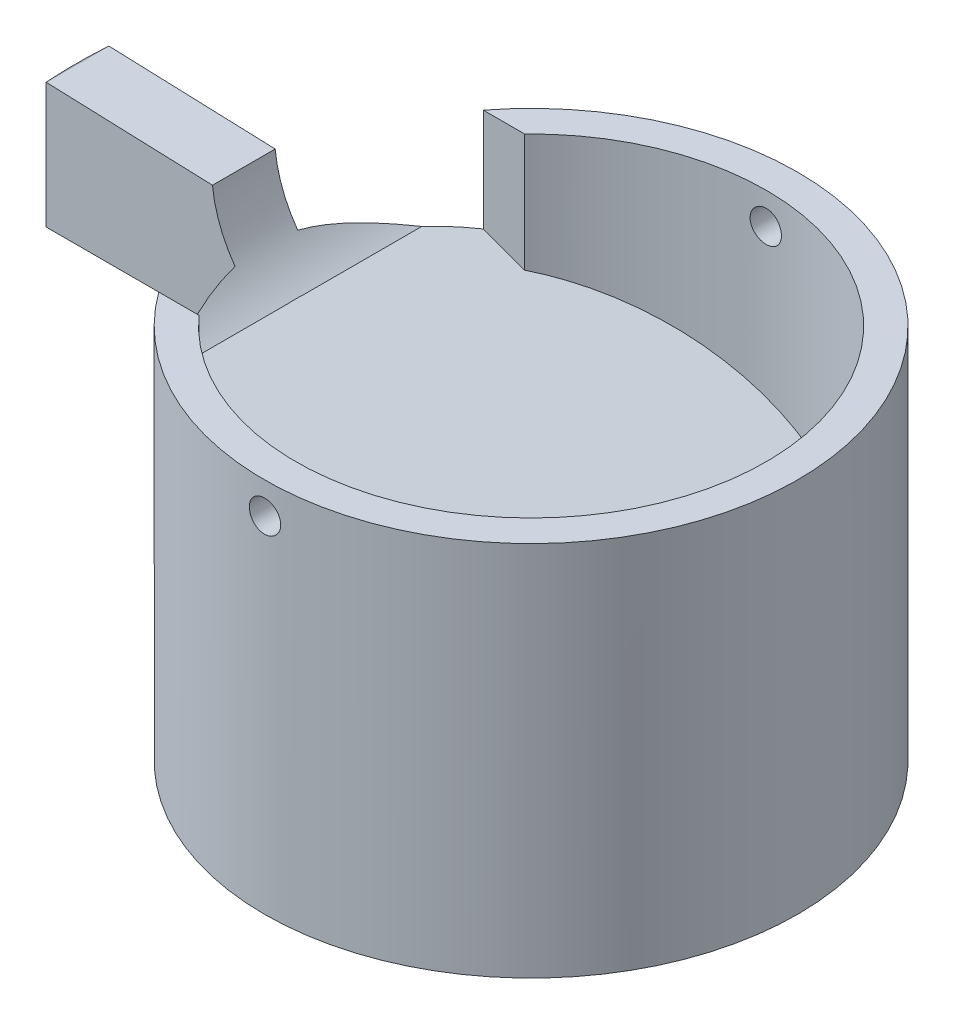
ISO-10303-21;
HEADER;
FILE_DESCRIPTION(('STEP AP214'),'2;1');
FILE_NAME('part.step','',(''),(''),'','','');
FILE_SCHEMA(('AUTOMOTIVE_DESIGN { 1 0 10303 214 1 1 1 1 }'));
ENDSEC;
DATA;
#1=APPLICATION_CONTEXT('core data for automotive mechanical design processes');
#2=APPLICATION_PROTOCOL_DEFINITION('international standard','automotive_design',2000,#1);
#3=PRODUCT_CONTEXT('',#1,'mechanical');
#4=PRODUCT('Part','Part','',(#3));
#5=PRODUCT_RELATED_PRODUCT_CATEGORY('part','',(#4));
#6=PRODUCT_DEFINITION_FORMATION('','',#4);
#7=PRODUCT_DEFINITION_CONTEXT('part definition',#1,'design');
#8=PRODUCT_DEFINITION('design','',#6,#7);
#9=PRODUCT_DEFINITION_SHAPE('','',#8);
#10=(LENGTH_UNIT() NAMED_UNIT(*) SI_UNIT(.MILLI.,.METRE.));
#11=(NAMED_UNIT(*) PLANE_ANGLE_UNIT() SI_UNIT($,.RADIAN.));
#12=(NAMED_UNIT(*) SI_UNIT($,.STERADIAN.) SOLID_ANGLE_UNIT());
#13=UNCERTAINTY_MEASURE_WITH_UNIT(LENGTH_MEASURE(1.E-05),#10,'distance_accuracy_value','');
#14=(GEOMETRIC_REPRESENTATION_CONTEXT(3) GLOBAL_UNCERTAINTY_ASSIGNED_CONTEXT((#13)) GLOBAL_UNIT_ASSIGNED_CONTEXT((#10,
#11,#12)) REPRESENTATION_CONTEXT('',''));
#15=CARTESIAN_POINT('',(0.,0.,0.));
#16=DIRECTION('',(0.,0.,1.));
#17=DIRECTION('',(1.,0.,0.));
#18=AXIS2_PLACEMENT_3D('',#15,#16,#17);
#19=CARTESIAN_POINT('',(0.,2.54,0.));
#20=DIRECTION('',(0.,-1.,0.));
#21=DIRECTION('',(0.,0.,-1.));
#22=AXIS2_PLACEMENT_3D('',#19,#20,#21);
#23=CYLINDRICAL_SURFACE('',#22,10.795);
#24=CARTESIAN_POINT('',(0.,14.605,-10.795));
#25=CARTESIAN_POINT('',(-0.0356351679028302,14.6049984305114,-10.7949997512112));
#26=CARTESIAN_POINT('',(-0.0712953888164794,14.6019902402342,-10.7948216602188));
#27=CARTESIAN_POINT('',(-0.141631462996185,14.5900329866575,-10.7941283412116));
#28=CARTESIAN_POINT('',(-0.176306116649345,14.5810769817256,-10.7936127192782));
#29=CARTESIAN_POINT('',(-0.24364203392896,14.557481966238,-10.7923026782896));
#30=CARTESIAN_POINT('',(-0.276304337938337,14.5428459213166,-10.7915084047433));
#31=CARTESIAN_POINT('',(-0.338699934121517,14.5083110186843,-10.7897304323745));
#32=CARTESIAN_POINT('',(-0.368433901447448,14.4884133779944,-10.7887467773707));
#33=CARTESIAN_POINT('',(-0.424177362457849,14.443890701376,-10.7866991598219));
#34=CARTESIAN_POINT('',(-0.450182412335665,14.4192601055436,-10.785635103729));
#35=CARTESIAN_POINT('',(-0.497691882372563,14.3659820617881,-10.7835474102903));
#36=CARTESIAN_POINT('',(-0.519196115819782,14.3373344473052,-10.7825237746228));
#37=CARTESIAN_POINT('',(-0.557106864552972,14.2768108597667,-10.7806316506993));
#38=CARTESIAN_POINT('',(-0.573509742886203,14.244932604833,-10.7797632733197));
#39=CARTESIAN_POINT('',(-0.600728877634353,14.1788686581651,-10.7782807859998));
#40=CARTESIAN_POINT('',(-0.611545188508298,14.1446829889278,-10.777666673581));
#41=CARTESIAN_POINT('',(-0.627271964873961,14.0750169614328,-10.7767628493504));
#42=CARTESIAN_POINT('',(-0.632189315829735,14.0395381625213,-10.7764727593562));
#43=CARTESIAN_POINT('',(-0.635999838951522,13.9682576168137,-10.7762485600005));
#44=CARTESIAN_POINT('',(-0.634893072779068,13.932455873327,-10.7763144469954));
#45=CARTESIAN_POINT('',(-0.626692498393133,13.8615925986699,-10.7767944203487));
#46=CARTESIAN_POINT('',(-0.619606137327857,13.8265302023458,-10.7772080735873));
#47=CARTESIAN_POINT('',(-0.599659076845762,13.7580934654282,-10.7783362790686));
#48=CARTESIAN_POINT('',(-0.586798346057755,13.7247191340068,-10.7790508329461));
#49=CARTESIAN_POINT('',(-0.555659144579365,13.6605819543332,-10.7807008094236));
#50=CARTESIAN_POINT('',(-0.53737729025201,13.6298207525588,-10.7816363698923));
#51=CARTESIAN_POINT('',(-0.495917252129849,13.5718010322396,-10.7836227843556));
#52=CARTESIAN_POINT('',(-0.472739019783895,13.544542548431,-10.7846736394934));
#53=CARTESIAN_POINT('',(-0.422102201088975,13.4942586986253,-10.7867741372838));
#54=CARTESIAN_POINT('',(-0.394637168478706,13.4712398234601,-10.7878237756721));
#55=CARTESIAN_POINT('',(-0.336228996905172,13.4301386630437,-10.7898020123731));
#56=CARTESIAN_POINT('',(-0.305285856851307,13.4120563793403,-10.7907306106477));
#57=CARTESIAN_POINT('',(-0.24079593980214,13.3813422638819,-10.7923621860591));
#58=CARTESIAN_POINT('',(-0.207249048376058,13.3687106718363,-10.7930651532727));
#59=CARTESIAN_POINT('',(-0.138505636411039,13.3492608105143,-10.7941661119478));
#60=CARTESIAN_POINT('',(-0.103309132947008,13.3424424810797,-10.7945641065652));
#61=CARTESIAN_POINT('',(-0.0323219232112934,13.3348207215515,-10.7950098637639));
#62=CARTESIAN_POINT('',(0.00346781625350325,13.3340083160628,-10.7950581489571));
#63=CARTESIAN_POINT('',(0.0746750763904674,13.3383980233625,-10.7948004353027));
#64=CARTESIAN_POINT('',(0.110092598774651,13.343600108475,-10.7944944380854));
#65=CARTESIAN_POINT('',(0.179524809539617,13.3598636982025,-10.7935629491922));
#66=CARTESIAN_POINT('',(0.213540464282049,13.370921091164,-10.7929376817219));
#67=CARTESIAN_POINT('',(0.279233168671747,13.3985772443067,-10.7914380133722));
#68=CARTESIAN_POINT('',(0.310910199671078,13.4151760486687,-10.7905636105066));
#69=CARTESIAN_POINT('',(0.371067598621917,13.4534667352667,-10.788662656604));
#70=CARTESIAN_POINT('',(0.399544140859852,13.4751646189663,-10.7876359268119));
#71=CARTESIAN_POINT('',(0.45245371986919,13.5230287950972,-10.7855464913238));
#72=CARTESIAN_POINT('',(0.476886721239911,13.5491951266451,-10.7844837853128));
#73=CARTESIAN_POINT('',(0.52104600023069,13.6052921202529,-10.7824406659812));
#74=CARTESIAN_POINT('',(0.540766460007563,13.6352273663385,-10.7814603553388));
#75=CARTESIAN_POINT('',(0.574901079497304,13.6979893599176,-10.7796942042566));
#76=CARTESIAN_POINT('',(0.589315268894863,13.7308160912339,-10.7789083627289));
#77=CARTESIAN_POINT('',(0.612418084838297,13.7984078784694,-10.7776205077862));
#78=CARTESIAN_POINT('',(0.621110388041395,13.8331716740989,-10.777118312141));
#79=CARTESIAN_POINT('',(0.632534702190092,13.9036683206369,-10.776453874154));
#80=CARTESIAN_POINT('',(0.635266764242213,13.9394011632335,-10.7762916288972));
#81=CARTESIAN_POINT('',(0.634692557207879,14.0107637144814,-10.7763254586403));
#82=CARTESIAN_POINT('',(0.631395436213615,14.0463934973603,-10.7765209907842));
#83=CARTESIAN_POINT('',(0.618875405376791,14.1165926516912,-10.7772471907755));
#84=CARTESIAN_POINT('',(0.609652484605007,14.1511620211874,-10.7777778592411));
#85=CARTESIAN_POINT('',(0.585544665404836,14.218260582559,-10.7791143975897));
#86=CARTESIAN_POINT('',(0.57065977794707,14.2507897783873,-10.7799202669396));
#87=CARTESIAN_POINT('',(0.535651888505864,14.3128884212245,-10.7817163708216));
#88=CARTESIAN_POINT('',(0.515529030124882,14.3424579493437,-10.7827066002992));
#89=CARTESIAN_POINT('',(0.470582834471317,14.3978441143606,-10.7847615725649));
#90=CARTESIAN_POINT('',(0.445752939002927,14.423655425241,-10.7858264179929));
#91=CARTESIAN_POINT('',(0.39210526914029,14.4707520469773,-10.7879097818941));
#92=CARTESIAN_POINT('',(0.363286518859819,14.4920362470185,-10.7889282889491));
#93=CARTESIAN_POINT('',(0.302449639447098,14.5294883113952,-10.7908051516502));
#94=CARTESIAN_POINT('',(0.270427875295563,14.5456502739411,-10.7916633220942));
#95=CARTESIAN_POINT('',(0.204143755580443,14.5723487804598,-10.7931202482389));
#96=CARTESIAN_POINT('',(0.169884084632205,14.5828919305877,-10.793719308424));
#97=CARTESIAN_POINT('',(0.112844811048659,14.5953052710544,-10.7944330625159));
#98=CARTESIAN_POINT('',(0.090434151646234,14.59893611232,-10.794644722565));
#99=CARTESIAN_POINT('',(0.0453523777244597,14.6037839748099,-10.7949282703976));
#100=CARTESIAN_POINT('',(0.0226812635204807,14.6050009989566,-10.7950001583504));
#101=CARTESIAN_POINT('',(0.,14.605,-10.795));
#102=B_SPLINE_CURVE_WITH_KNOTS('',3,(#24,#25,#26,#27,#28,#29,#30,#31,#32,#33,#34,#35,#36,#37,
#38,#39,#40,#41,#42,#43,#44,#45,#46,#47,#48,#49,#50,#51,#52,#53,#54,#55,#56,#57,#58,#59,#60,#61,
#62,#63,#64,#65,#66,#67,#68,#69,#70,#71,#72,#73,#74,#75,#76,#77,#78,#79,#80,#81,#82,#83,#84,#85,
#86,#87,#88,#89,#90,#91,#92,#93,#94,#95,#96,#97,#98,#99,#100,#101),.UNSPECIFIED.,.T.,.F.,(4,2,2,
2,2,2,2,2,2,2,2,2,2,2,2,2,2,2,2,2,2,2,2,2,2,2,2,2,2,2,2,2,2,2,2,2,2,2,4),(0.,0.106822705228081,
0.213770301730541,0.320662134244783,0.427529263986997,0.534522708895927,0.641520591441441,
0.748594582953567,0.855667530666389,0.962615377255058,1.06956212915121,1.17637588294043,
1.28319021703798,1.39007136097883,1.49695356477369,1.60399806891824,1.71104260662795,
1.81809185144362,1.92513998845194,2.03202811778548,2.13891575527069,2.24572843456736,
2.35254196548489,2.45948184797901,2.56642266666857,2.67349483430051,2.7805664029331,
2.88756910428779,2.99457088813641,3.10141045264642,3.20825021420612,3.31508976875425,
3.42192639453336,3.52891298189507,3.63592579028968,3.74306145323786,3.85007087509999,
3.91806204795704,3.9860531384959),.UNSPECIFIED.);
#103=CARTESIAN_POINT('',(0.,14.605,-10.795));
#104=VERTEX_POINT('',#103);
#105=EDGE_CURVE('E214',#104,#104,#102,.T.);
#106=ORIENTED_EDGE('',*,*,#105,.T.);
#107=EDGE_LOOP('',(#106));
#108=FACE_BOUND('',#107,.T.);
#109=CARTESIAN_POINT('',(0.635,13.97,10.776307345283));
#110=CARTESIAN_POINT('',(0.634998430456802,13.9343648922448,10.776307595683));
#111=CARTESIAN_POINT('',(0.631990249990912,13.8987047312758,10.7764860031319));
#112=CARTESIAN_POINT('',(0.620033038930915,13.8283687816519,10.7771804527855));
#113=CARTESIAN_POINT('',(0.6110770665001,13.7936941926569,10.7776968895037));
#114=CARTESIAN_POINT('',(0.58748214610126,13.7263584120583,10.7790086986584));
#115=CARTESIAN_POINT('',(0.572846165317512,13.693696179524,10.7798039254368));
#116=CARTESIAN_POINT('',(0.538311413693691,13.6313007029472,10.7815835261035));
#117=CARTESIAN_POINT('',(0.518413859715782,13.6015667838429,10.782567856243));
#118=CARTESIAN_POINT('',(0.473891270426229,13.5458232677524,10.7846162558725));
#119=CARTESIAN_POINT('',(0.449260655864382,13.5198181299968,10.7856804185562));
#120=CARTESIAN_POINT('',(0.395982537837461,13.4723084905347,10.7877677051114));
#121=CARTESIAN_POINT('',(0.367334868051445,13.4508041752707,10.7887908272813));
#122=CARTESIAN_POINT('',(0.306811232683129,13.4128933414721,10.7906815257061));
#123=CARTESIAN_POINT('',(0.274932994727201,13.3964904447269,10.7915489912674));
#124=CARTESIAN_POINT('',(0.208869084976209,13.3692712712459,10.7930296598888));
#125=CARTESIAN_POINT('',(0.174683435586024,13.3584549402737,10.7936428654174));
#126=CARTESIAN_POINT('',(0.105017466316431,13.3427281211832,10.7945452801555));
#127=CARTESIAN_POINT('',(0.0695387061149953,13.3378107460917,10.7948348671594));
#128=CARTESIAN_POINT('',(-0.00174176398710834,13.334000161289,10.7950586845617));
#129=CARTESIAN_POINT('',(-0.037543470592153,13.3351068901719,10.7949929185822));
#130=CARTESIAN_POINT('',(-0.108406911130858,13.3433074060521,10.794513756815));
#131=CARTESIAN_POINT('',(-0.143469505839238,13.3503937834231,10.7941007912587));
#132=CARTESIAN_POINT('',(-0.211906631124902,13.3703409454908,10.7929742260157));
#133=CARTESIAN_POINT('',(-0.245281152636635,13.3832017611947,10.7922606247147));
#134=CARTESIAN_POINT('',(-0.309418560666985,13.4143411373942,10.7906124053051));
#135=CARTESIAN_POINT('',(-0.340179810435412,13.4326230615322,10.7896776500499));
#136=CARTESIAN_POINT('',(-0.398199597030783,13.474083248063,10.7876923437949));
#137=CARTESIAN_POINT('',(-0.425458099090825,13.4972615590495,10.7866417916459));
#138=CARTESIAN_POINT('',(-0.475741858081766,13.5478984328716,10.7845412691706));
#139=CARTESIAN_POINT('',(-0.498760640115146,13.5753634260814,10.7834913021361));
#140=CARTESIAN_POINT('',(-0.539861631495835,13.63377148588,10.7815119155351));
#141=CARTESIAN_POINT('',(-0.557943839107549,13.6647145536916,10.7805824960109));
#142=CARTESIAN_POINT('',(-0.588657900066787,13.7292044525688,10.7789491420335));
#143=CARTESIAN_POINT('',(-0.601289489964701,13.7627514093981,10.7782452184798));
#144=CARTESIAN_POINT('',(-0.620739326887917,13.8314949633144,10.7771426363621));
#145=CARTESIAN_POINT('',(-0.627557634459885,13.8666915432161,10.7767439746188));
#146=CARTESIAN_POINT('',(-0.635179311746742,13.9376787862767,10.7762974674556));
#147=CARTESIAN_POINT('',(-0.635991677612388,13.9734684803923,10.7762490973448));
#148=CARTESIAN_POINT('',(-0.631601907259025,14.0446756402626,10.7765072578334));
#149=CARTESIAN_POINT('',(-0.626399798712744,14.0800931077293,10.7768137868));
#150=CARTESIAN_POINT('',(-0.610136217537283,14.1495250566157,10.7777467209338));
#151=CARTESIAN_POINT('',(-0.599078880012128,14.1835405099217,10.778372900345));
#152=CARTESIAN_POINT('',(-0.57142290534505,14.2492328360255,10.7798743747025));
#153=CARTESIAN_POINT('',(-0.554824223697973,14.2809096900384,10.7807496716496));
#154=CARTESIAN_POINT('',(-0.516533715758926,14.3410669718491,10.7826520118225));
#155=CARTESIAN_POINT('',(-0.494835856785447,14.369543554056,10.7836792342489));
#156=CARTESIAN_POINT('',(-0.446971707445749,14.4224532252556,10.785769032059));
#157=CARTESIAN_POINT('',(-0.420805378151595,14.4468862790187,10.7868316077506));
#158=CARTESIAN_POINT('',(-0.364708360969966,14.4910456663156,10.7888739001381));
#159=CARTESIAN_POINT('',(-0.334773088795057,14.5107661817178,10.7898535134551));
#160=CARTESIAN_POINT('',(-0.272011028670234,14.544900898908,10.7916180080894));
#161=CARTESIAN_POINT('',(-0.239184256899886,14.5593151303853,10.7924028904962));
#162=CARTESIAN_POINT('',(-0.171592499189545,14.5824179752596,10.793688985023));
#163=CARTESIAN_POINT('',(-0.136828779773764,14.5911102835192,10.7941903801719));
#164=CARTESIAN_POINT('',(-0.0663322935746651,14.602534633623,10.794853729708));
#165=CARTESIAN_POINT('',(-0.03059953503743,14.6052667261698,10.7950156869827));
#166=CARTESIAN_POINT('',(0.0407630724980352,14.6046926059981,10.7949819208267));
#167=CARTESIAN_POINT('',(0.0763929954153116,14.6013955050053,10.7947867371314));
#168=CARTESIAN_POINT('',(0.146592434692461,14.5888754648087,10.7940617152066));
#169=CARTESIAN_POINT('',(0.181161949141328,14.5796525149265,10.7935318763741));
#170=CARTESIAN_POINT('',(0.248260793611586,14.5555445851396,10.7921971154391));
#171=CARTESIAN_POINT('',(0.280790127498629,14.5406596159636,10.7913921938578));
#172=CARTESIAN_POINT('',(0.342889012202801,14.5056515205175,10.7895976891687));
#173=CARTESIAN_POINT('',(0.372458644215312,14.4855285379998,10.7886081111288));
#174=CARTESIAN_POINT('',(0.427844797598306,14.440582208147,10.7865538675594));
#175=CARTESIAN_POINT('',(0.453656015822752,14.4157523308387,10.7854890990196));
#176=CARTESIAN_POINT('',(0.500752459124582,14.3621047350907,10.7834052737543));
#177=CARTESIAN_POINT('',(0.522036573148118,14.333286040563,10.7823862282986));
#178=CARTESIAN_POINT('',(0.559488547608996,14.2724492041951,10.7805079052902));
#179=CARTESIAN_POINT('',(0.575650490094764,14.240427417396,10.7796488130102));
#180=CARTESIAN_POINT('',(0.602348952785157,14.1741432491827,10.7781900703068));
#181=CARTESIAN_POINT('',(0.612892079452664,14.1398835525135,10.7775901153543));
#182=CARTESIAN_POINT('',(0.62530535208927,14.0828443419739,10.7768752385854));
#183=CARTESIAN_POINT('',(0.628936162871599,14.0604337761312,10.7766632262825));
#184=CARTESIAN_POINT('',(0.63378398485156,14.0153521897637,10.7763792000288));
#185=CARTESIAN_POINT('',(0.635000998988852,13.9926811695563,10.7763071859075));
#186=CARTESIAN_POINT('',(0.635,13.97,10.776307345283));
#187=B_SPLINE_CURVE_WITH_KNOTS('',3,(#109,#110,#111,#112,#113,#114,#115,#116,#117,#118,#119,
#120,#121,#122,#123,#124,#125,#126,#127,#128,#129,#130,#131,#132,#133,#134,#135,#136,#137,#138,
#139,#140,#141,#142,#143,#144,#145,#146,#147,#148,#149,#150,#151,#152,#153,#154,#155,#156,#157,
#158,#159,#160,#161,#162,#163,#164,#165,#166,#167,#168,#169,#170,#171,#172,#173,#174,#175,#176,
#177,#178,#179,#180,#181,#182,#183,#184,#185,#186),.UNSPECIFIED.,.T.,.F.,(4,2,2,2,2,2,2,2,2,2,2,
2,2,2,2,2,2,2,2,2,2,2,2,2,2,2,2,2,2,2,2,2,2,2,2,2,2,2,4),(0.,0.106822524585765,
0.213769944393202,0.320661570889389,0.4275284977792,0.534522179008842,0.641520291481271,
0.748594195547976,0.855667060080598,0.96261479605214,1.06956144186877,1.17637576001133,
1.2831906517238,1.39007195818964,1.49695432543553,1.60399859387924,1.71104289995735,
1.8180923793248,1.92514074373379,2.03202873051091,2.13891622549602,2.24572833442969,
2.35254130124257,2.45948127709416,2.56642218462137,2.67349444776535,2.78056611181786,
2.8875685676408,2.99457011320707,3.10141008441141,3.20825024814513,3.31509020943628,
3.42192723891514,3.52891358495897,3.63592615765447,3.74306192143013,3.85007143818261,
3.91806232963468,3.98605313828346),.UNSPECIFIED.);
#188=CARTESIAN_POINT('',(0.635,13.97,10.776307345283));
#189=VERTEX_POINT('',#188);
#190=EDGE_CURVE('E208',#189,#189,#187,.T.);
#191=ORIENTED_EDGE('',*,*,#190,.T.);
#192=EDGE_LOOP('',(#191));
#193=FACE_BOUND('',#192,.T.);
#194=CARTESIAN_POINT('',(0.,0.,0.));
#195=DIRECTION('',(0.,1.,0.));
#196=DIRECTION('',(0.,0.,1.));
#197=AXIS2_PLACEMENT_3D('',#194,#195,#196);
#198=CIRCLE('',#197,10.795);
#199=CARTESIAN_POINT('',(0.,0.,10.795));
#200=VERTEX_POINT('',#199);
#201=EDGE_CURVE('E169',#200,#200,#198,.T.);
#202=ORIENTED_EDGE('',*,*,#201,.T.);
#203=EDGE_LOOP('',(#202));
#204=FACE_BOUND('',#203,.T.);
#205=CARTESIAN_POINT('',(-9.51829444013113,11.427565374167,-5.09255298951016));
#206=CARTESIAN_POINT('',(-9.59157043862955,11.4782246691972,-4.95558199705393));
#207=CARTESIAN_POINT('',(-9.6617740442098,11.529684474168,-4.81727298617212));
#208=CARTESIAN_POINT('',(-9.79605895343411,11.6333607530782,-4.53798409437742));
#209=CARTESIAN_POINT('',(-9.86014002798266,11.6855772552479,-4.39700411375737));
#210=CARTESIAN_POINT('',(-9.9824890376812,11.7901684146021,-4.11170743725739));
#211=CARTESIAN_POINT('',(-10.040727675398,11.8425426322349,-3.96737799866808));
#212=CARTESIAN_POINT('',(-10.151020277541,11.9462229514204,-3.67601225736131));
#213=CARTESIAN_POINT('',(-10.2030743072295,11.9975290642396,-3.52897598322635));
#214=CARTESIAN_POINT('',(-10.3517223670382,12.1501667489695,-3.07820298174117));
#215=CARTESIAN_POINT('',(-10.4385489236373,12.2482211312549,-2.77003509422644));
#216=CARTESIAN_POINT('',(-10.5851929047094,12.4244095191374,-2.14223333594494));
#217=CARTESIAN_POINT('',(-10.645072873382,12.5025894685528,-1.82262789481439));
#218=CARTESIAN_POINT('',(-10.716692111956,12.5996267044875,-1.31147562028735));
#219=CARTESIAN_POINT('',(-10.7380724483608,12.62956742296,-1.1233812459478));
#220=CARTESIAN_POINT('',(-10.7709599577538,12.6762381473256,-0.744672544060892));
#221=CARTESIAN_POINT('',(-10.7824686126926,12.6929701361015,-0.554058599119102));
#222=CARTESIAN_POINT('',(-10.7952642490611,12.7116036795804,-0.173642033009788));
#223=CARTESIAN_POINT('',(-10.7966512942914,12.7136504116108,0.0161499390215722));
#224=CARTESIAN_POINT('',(-10.7894308310511,12.7031025440371,0.395138863048495));
#225=CARTESIAN_POINT('',(-10.7808225578839,12.6905068242054,0.584335768407761));
#226=CARTESIAN_POINT('',(-10.7539033724832,12.651939531234,0.959581313998239));
#227=CARTESIAN_POINT('',(-10.7356452265865,12.6260407219934,1.1456414515068));
#228=CARTESIAN_POINT('',(-10.6898182746418,12.562959942602,1.51473705282926));
#229=CARTESIAN_POINT('',(-10.6622441800812,12.5257715647657,1.69777073652897));
#230=CARTESIAN_POINT('',(-10.5979093602633,12.4421869521598,2.06174706998924));
#231=CARTESIAN_POINT('',(-10.5610716298376,12.3957142414026,2.24265817591438));
#232=CARTESIAN_POINT('',(-10.478682218186,12.2962059749828,2.60056988148147));
#233=CARTESIAN_POINT('',(-10.4331324918793,12.2431718925933,2.77757134850202));
#234=CARTESIAN_POINT('',(-10.3298251036076,12.1285633830587,3.14086411869082));
#235=CARTESIAN_POINT('',(-10.2714088477536,12.0666468331537,3.32685903708249));
#236=CARTESIAN_POINT('',(-10.1449469921606,11.9400292037482,3.69457345333499));
#237=CARTESIAN_POINT('',(-10.076900907038,11.8753279840031,3.87629273514711));
#238=CARTESIAN_POINT('',(-9.93238277511039,11.7461375212253,4.2327562264702));
#239=CARTESIAN_POINT('',(-9.8560588367685,11.6816607348215,4.40756503672717));
#240=CARTESIAN_POINT('',(-9.69413821018559,11.5535662416918,4.7531060884313));
#241=CARTESIAN_POINT('',(-9.60854343472779,11.4899483607891,4.92383916195706));
#242=CARTESIAN_POINT('',(-9.51829444013113,11.427565374167,5.09255298951016));
#243=B_SPLINE_CURVE_WITH_KNOTS('',3,(#205,#206,#207,#208,#209,#210,#211,#212,#213,#214,#215,
#216,#217,#218,#219,#220,#221,#222,#223,#224,#225,#226,#227,#228,#229,#230,#231,#232,#233,#234,
#235,#236,#237,#238,#239,#240,#241,#242),.UNSPECIFIED.,.F.,.F.,(4,2,2,2,2,2,2,2,2,2,2,2,2,2,2,2,
2,2,4),(0.,0.490126297104773,0.980270926789666,1.47276199271296,1.96524786121707,
2.96827196175247,3.96895583809988,4.54331571794176,5.1175893589867,5.68617785209922,
6.25480984820298,6.82036420360699,7.38624015599875,7.95698520876742,8.52760233973769,
9.14093262709674,9.75429383987877,10.3580805847688,10.9617429912608),.UNSPECIFIED.);
#244=CARTESIAN_POINT('',(-10.7200338152452,12.6045787394228,1.27));
#245=VERTEX_POINT('',#244);
#246=CARTESIAN_POINT('',(-9.51829444013113,11.427565374167,5.09255298951016));
#247=VERTEX_POINT('',#246);
#248=EDGE_CURVE('E133',#245,#247,#243,.T.);
#249=ORIENTED_EDGE('',*,*,#248,.F.);
#250=DIRECTION('',(0.,-1.,0.));
#251=VECTOR('',#250,1.);
#252=CARTESIAN_POINT('',(-10.7200338152452,2.54,1.27));
#253=LINE('',#252,#251);
#254=CARTESIAN_POINT('',(-10.7200338152452,10.16,1.27));
#255=VERTEX_POINT('',#254);
#256=EDGE_CURVE('E61',#245,#255,#253,.T.);
#257=ORIENTED_EDGE('',*,*,#256,.T.);
#258=CARTESIAN_POINT('',(0.,10.16,0.));
#259=DIRECTION('',(0.,1.,0.));
#260=DIRECTION('',(0.,0.,1.));
#261=AXIS2_PLACEMENT_3D('',#258,#259,#260);
#262=CIRCLE('',#261,10.795);
#263=CARTESIAN_POINT('',(-10.7200338152452,10.16,-1.27));
#264=VERTEX_POINT('',#263);
#265=EDGE_CURVE('E46',#264,#255,#262,.T.);
#266=ORIENTED_EDGE('',*,*,#265,.F.);
#267=DIRECTION('',(0.,-1.,0.));
#268=VECTOR('',#267,1.);
#269=CARTESIAN_POINT('',(-10.7200338152452,2.54,-1.27));
#270=LINE('',#269,#268);
#271=CARTESIAN_POINT('',(-10.7200338152452,12.6045787394228,-1.27));
#272=VERTEX_POINT('',#271);
#273=EDGE_CURVE('E157',#264,#272,#270,.F.);
#274=ORIENTED_EDGE('',*,*,#273,.T.);
#275=CARTESIAN_POINT('',(-9.51829444013113,11.427565374167,-5.09255298951015));
#276=VERTEX_POINT('',#275);
#277=EDGE_CURVE('E134',#276,#272,#243,.T.);
#278=ORIENTED_EDGE('',*,*,#277,.F.);
#279=CARTESIAN_POINT('',(0.,7.97170397208862,0.));
#280=DIRECTION('',(0.341277564846786,0.939962565069614,0.));
#281=DIRECTION('',(0.939962565069614,-0.341277564846786,0.));
#282=AXIS2_PLACEMENT_3D('',#279,#280,#281);
#283=ELLIPSE('',#282,11.4844999164414,10.795);
#284=CARTESIAN_POINT('',(-8.53927450079924,11.0721070258796,-6.604));
#285=VERTEX_POINT('',#284);
#286=EDGE_CURVE('E185',#285,#276,#283,.T.);
#287=ORIENTED_EDGE('',*,*,#286,.F.);
#288=DIRECTION('',(0.,-1.,0.));
#289=VECTOR('',#288,1.);
#290=CARTESIAN_POINT('',(-8.53927450079924,2.54,-6.604));
#291=LINE('',#290,#289);
#292=CARTESIAN_POINT('',(-8.53927450079924,15.24,-6.604));
#293=VERTEX_POINT('',#292);
#294=EDGE_CURVE('E271',#293,#285,#291,.T.);
#295=ORIENTED_EDGE('',*,*,#294,.F.);
#296=CARTESIAN_POINT('',(0.,15.24,0.));
#297=DIRECTION('',(0.,1.,0.));
#298=DIRECTION('',(0.,0.,1.));
#299=AXIS2_PLACEMENT_3D('',#296,#297,#298);
#300=CIRCLE('',#299,10.795);
#301=CARTESIAN_POINT('',(-8.72980669889088,15.24,6.35));
#302=VERTEX_POINT('',#301);
#303=EDGE_CURVE('E166',#302,#293,#300,.T.);
#304=ORIENTED_EDGE('',*,*,#303,.F.);
#305=DIRECTION('',(0.,-1.,0.));
#306=VECTOR('',#305,1.);
#307=CARTESIAN_POINT('',(-8.72980669889088,2.54,6.35));
#308=LINE('',#307,#306);
#309=CARTESIAN_POINT('',(-8.72980669889088,11.1412846367824,6.35));
#310=VERTEX_POINT('',#309);
#311=EDGE_CURVE('E265',#302,#310,#308,.T.);
#312=ORIENTED_EDGE('',*,*,#311,.T.);
#313=EDGE_CURVE('E233',#247,#310,#283,.T.);
#314=ORIENTED_EDGE('',*,*,#313,.F.);
#315=EDGE_LOOP('',(#249,#257,#266,#274,#278,#287,#295,#304,#312,#314));
#316=FACE_BOUND('',#315,.T.);
#317=ADVANCED_FACE('F35',(#108,#193,#204,#316),#23,.T.);
#318=CARTESIAN_POINT('',(0.,15.24,0.));
#319=DIRECTION('',(0.,1.,0.));
#320=DIRECTION('',(0.,0.,1.));
#321=AXIS2_PLACEMENT_3D('',#318,#319,#320);
#322=PLANE('',#321);
#323=DIRECTION('',(1.,0.,0.));
#324=VECTOR('',#323,1.);
#325=CARTESIAN_POINT('',(0.,15.24,6.35));
#326=LINE('',#325,#324);
#327=CARTESIAN_POINT('',(-7.09951582856184,15.24,6.35));
#328=VERTEX_POINT('',#327);
#329=EDGE_CURVE('E267',#302,#328,#326,.T.);
#330=ORIENTED_EDGE('',*,*,#329,.F.);
#331=ORIENTED_EDGE('',*,*,#303,.T.);
#332=DIRECTION('',(1.,0.,0.));
#333=VECTOR('',#332,1.);
#334=CARTESIAN_POINT('',(0.,15.24,-6.604));
#335=LINE('',#334,#333);
#336=CARTESIAN_POINT('',(-6.86387711137081,15.24,-6.604));
#337=VERTEX_POINT('',#336);
#338=EDGE_CURVE('E273',#293,#337,#335,.T.);
#339=ORIENTED_EDGE('',*,*,#338,.T.);
#340=CARTESIAN_POINT('',(0.,15.24,0.));
#341=DIRECTION('',(0.,1.,0.));
#342=DIRECTION('',(0.,0.,1.));
#343=AXIS2_PLACEMENT_3D('',#340,#341,#342);
#344=CIRCLE('',#343,9.52500000000001);
#345=EDGE_CURVE('E163',#328,#337,#344,.T.);
#346=ORIENTED_EDGE('',*,*,#345,.F.);
#347=EDGE_LOOP('',(#330,#331,#339,#346));
#348=FACE_BOUND('',#347,.T.);
#349=ADVANCED_FACE('F227',(#348),#322,.T.);
#350=CARTESIAN_POINT('',(-9.525,10.16,1.27));
#351=DIRECTION('',(0.,0.,1.));
#352=DIRECTION('',(1.,0.,0.));
#353=AXIS2_PLACEMENT_3D('',#350,#351,#352);
#354=PLANE('',#353);
#355=ORIENTED_EDGE('',*,*,#256,.F.);
#356=CARTESIAN_POINT('',(-6.69174386377524,15.5154935653288,1.27));
#357=DIRECTION('',(0.,0.,1.));
#358=DIRECTION('',(1.,0.,0.));
#359=AXIS2_PLACEMENT_3D('',#356,#357,#358);
#360=CIRCLE('',#359,4.9699642912996);
#361=CARTESIAN_POINT('',(-11.6344338152452,14.9955309701056,1.26999999999999));
#362=VERTEX_POINT('',#361);
#363=EDGE_CURVE('E123',#245,#362,#360,.F.);
#364=ORIENTED_EDGE('',*,*,#363,.T.);
#365=DIRECTION('',(0.999342202961952,-0.0362651537864219,0.));
#366=VECTOR('',#365,1.);
#367=CARTESIAN_POINT('',(-9.35252832374261,14.9127228455911,1.27));
#368=LINE('',#367,#366);
#369=CARTESIAN_POINT('',(-18.3711546996916,15.24,1.26999999999999));
#370=VERTEX_POINT('',#369);
#371=EDGE_CURVE('E130',#370,#362,#368,.T.);
#372=ORIENTED_EDGE('',*,*,#371,.F.);
#373=DIRECTION('',(0.,1.,0.));
#374=VECTOR('',#373,1.);
#375=CARTESIAN_POINT('',(-18.3711546996916,10.16,1.27));
#376=LINE('',#375,#374);
#377=CARTESIAN_POINT('',(-18.3711546996916,10.16,1.27));
#378=VERTEX_POINT('',#377);
#379=EDGE_CURVE('E155',#378,#370,#376,.T.);
#380=ORIENTED_EDGE('',*,*,#379,.F.);
#381=DIRECTION('',(1.,0.,0.));
#382=VECTOR('',#381,1.);
#383=CARTESIAN_POINT('',(-9.525,10.16,1.27));
#384=LINE('',#383,#382);
#385=EDGE_CURVE('E152',#378,#255,#384,.T.);
#386=ORIENTED_EDGE('',*,*,#385,.T.);
#387=EDGE_LOOP('',(#355,#364,#372,#380,#386));
#388=FACE_BOUND('',#387,.T.);
#389=ADVANCED_FACE('F129',(#388),#354,.T.);
#390=CARTESIAN_POINT('',(-9.525,10.16,-1.27));
#391=DIRECTION('',(0.,0.,-1.));
#392=DIRECTION('',(-1.,0.,0.));
#393=AXIS2_PLACEMENT_3D('',#390,#391,#392);
#394=PLANE('',#393);
#395=DIRECTION('',(-0.999342202961952,0.0362651537864219,0.));
#396=VECTOR('',#395,1.);
#397=CARTESIAN_POINT('',(-9.35252832374261,14.9127228455911,-1.27));
#398=LINE('',#397,#396);
#399=CARTESIAN_POINT('',(-11.6344338152452,14.9955309701056,-1.27));
#400=VERTEX_POINT('',#399);
#401=CARTESIAN_POINT('',(-18.3711546996916,15.24,-1.26999999999998));
#402=VERTEX_POINT('',#401);
#403=EDGE_CURVE('E140',#400,#402,#398,.T.);
#404=ORIENTED_EDGE('',*,*,#403,.F.);
#405=CARTESIAN_POINT('',(-6.69174386377524,15.5154935653288,-1.27));
#406=DIRECTION('',(0.,0.,-1.));
#407=DIRECTION('',(-1.,0.,0.));
#408=AXIS2_PLACEMENT_3D('',#405,#406,#407);
#409=CIRCLE('',#408,4.9699642912996);
#410=EDGE_CURVE('E54',#400,#272,#409,.F.);
#411=ORIENTED_EDGE('',*,*,#410,.T.);
#412=ORIENTED_EDGE('',*,*,#273,.F.);
#413=DIRECTION('',(-1.,0.,0.));
#414=VECTOR('',#413,1.);
#415=CARTESIAN_POINT('',(-9.525,10.16,-1.27));
#416=LINE('',#415,#414);
#417=CARTESIAN_POINT('',(-18.3711546996916,10.16,-1.27));
#418=VERTEX_POINT('',#417);
#419=EDGE_CURVE('E143',#264,#418,#416,.T.);
#420=ORIENTED_EDGE('',*,*,#419,.T.);
#421=DIRECTION('',(0.,1.,0.));
#422=VECTOR('',#421,1.);
#423=CARTESIAN_POINT('',(-18.3711546996916,10.16,-1.27));
#424=LINE('',#423,#422);
#425=EDGE_CURVE('E153',#418,#402,#424,.T.);
#426=ORIENTED_EDGE('',*,*,#425,.T.);
#427=EDGE_LOOP('',(#404,#411,#412,#420,#426));
#428=FACE_BOUND('',#427,.T.);
#429=ADVANCED_FACE('F351',(#428),#394,.T.);
#430=DIRECTION('',(0.,0.,1.));
#431=VECTOR('',#430,1.);
#432=CARTESIAN_POINT('',(-18.3711546996916,15.24,-2.54));
#433=LINE('',#432,#431);
#434=EDGE_CURVE('E138',#402,#370,#433,.T.);
#435=ORIENTED_EDGE('',*,*,#434,.F.);
#436=CARTESIAN_POINT('',(0.,15.24,0.));
#437=DIRECTION('',(0.,1.,0.));
#438=DIRECTION('',(0.,0.,1.));
#439=AXIS2_PLACEMENT_3D('',#436,#437,#438);
#440=CIRCLE('',#439,18.415);
#441=EDGE_CURVE('E139',#402,#370,#440,.T.);
#442=ORIENTED_EDGE('',*,*,#441,.T.);
#443=EDGE_LOOP('',(#435,#442));
#444=FACE_BOUND('',#443,.T.);
#445=ADVANCED_FACE('F356',(#444),#322,.T.);
#446=CARTESIAN_POINT('',(0.,0.,0.));
#447=DIRECTION('',(0.,1.,0.));
#448=DIRECTION('',(0.,0.,1.));
#449=AXIS2_PLACEMENT_3D('',#446,#447,#448);
#450=PLANE('',#449);
#451=ORIENTED_EDGE('',*,*,#201,.F.);
#452=EDGE_LOOP('',(#451));
#453=FACE_BOUND('',#452,.T.);
#454=ADVANCED_FACE('F344',(#453),#450,.F.);
#455=CARTESIAN_POINT('',(0.,15.24,0.));
#456=DIRECTION('',(0.,-1.,0.));
#457=DIRECTION('',(0.,0.,-1.));
#458=AXIS2_PLACEMENT_3D('',#455,#456,#457);
#459=CYLINDRICAL_SURFACE('',#458,9.52500000000001);
#460=DIRECTION('',(0.,-1.,0.));
#461=VECTOR('',#460,1.);
#462=CARTESIAN_POINT('',(-7.09951582856184,15.24,6.35));
#463=LINE('',#462,#461);
#464=CARTESIAN_POINT('',(-7.09951582856184,10.5493656403311,6.35));
#465=VERTEX_POINT('',#464);
#466=EDGE_CURVE('E269',#328,#465,#463,.T.);
#467=ORIENTED_EDGE('',*,*,#466,.F.);
#468=ORIENTED_EDGE('',*,*,#345,.T.);
#469=DIRECTION('',(0.,-1.,0.));
#470=VECTOR('',#469,1.);
#471=CARTESIAN_POINT('',(-6.86387711137081,15.24,-6.604));
#472=LINE('',#471,#470);
#473=CARTESIAN_POINT('',(-6.86387711137081,10.4638109485007,-6.604));
#474=VERTEX_POINT('',#473);
#475=EDGE_CURVE('E238',#337,#474,#472,.T.);
#476=ORIENTED_EDGE('',*,*,#475,.T.);
#477=CARTESIAN_POINT('',(0.,7.97170397208862,0.));
#478=DIRECTION('',(0.341277564846786,0.939962565069614,0.));
#479=DIRECTION('',(0.939962565069614,-0.341277564846786,0.));
#480=AXIS2_PLACEMENT_3D('',#477,#478,#479);
#481=ELLIPSE('',#480,10.133382279213,9.52500000000001);
#482=EDGE_CURVE('E172',#465,#474,#481,.T.);
#483=ORIENTED_EDGE('',*,*,#482,.F.);
#484=EDGE_LOOP('',(#467,#468,#476,#483));
#485=FACE_BOUND('',#484,.T.);
#486=CARTESIAN_POINT('',(0.,14.605,-9.52500000000001));
#487=CARTESIAN_POINT('',(-0.0356257801606192,14.6049984343769,-9.52499971932025));
#488=CARTESIAN_POINT('',(-0.0712763827503177,14.6019918223554,-9.5247979902473));
#489=CARTESIAN_POINT('',(-0.141592841947689,14.5900412035686,-9.52401264720586));
#490=CARTESIAN_POINT('',(-0.176257509233121,14.5810903187743,-9.52342859086343));
#491=CARTESIAN_POINT('',(-0.243573406273407,14.5575096992981,-9.5219446531168));
#492=CARTESIAN_POINT('',(-0.27622570106043,14.54288299893,-9.52104494048834));
#493=CARTESIAN_POINT('',(-0.338603250454699,14.5083709595963,-9.51903083036324));
#494=CARTESIAN_POINT('',(-0.368329165453818,14.4884868108219,-9.51791648147186));
#495=CARTESIAN_POINT('',(-0.424068620656366,14.44398774863,-9.51559621992981));
#496=CARTESIAN_POINT('',(-0.450076574240903,14.4193658438094,-9.51439017357418));
#497=CARTESIAN_POINT('',(-0.497594022829724,14.3661046994104,-9.51202358312379));
#498=CARTESIAN_POINT('',(-0.519103328203576,14.3374652905682,-9.51086304094883));
#499=CARTESIAN_POINT('',(-0.557030547307453,14.2769499250058,-9.5087172878818));
#500=CARTESIAN_POINT('',(-0.573443753622251,14.2450710117191,-9.5077322394542));
#501=CARTESIAN_POINT('',(-0.600682756843666,14.1790022651945,-9.50605031265559));
#502=CARTESIAN_POINT('',(-0.611508620639647,14.1448124596272,-9.50535343083479));
#503=CARTESIAN_POINT('',(-0.627249951614484,14.0751468276728,-9.5043277131984));
#504=CARTESIAN_POINT('',(-0.6321742604315,14.0396730073388,-9.50399832685679));
#505=CARTESIAN_POINT('',(-0.635999996417602,13.9684008809439,-9.50374309753313));
#506=CARTESIAN_POINT('',(-0.634901499725566,13.9326025789908,-9.50381724944962));
#507=CARTESIAN_POINT('',(-0.626720137700694,13.8617579787303,-9.50436022355584));
#508=CARTESIAN_POINT('',(-0.619646847282813,13.8267105691681,-9.50482841427369));
#509=CARTESIAN_POINT('',(-0.599731538400508,13.7583016105779,-9.50610571202188));
#510=CARTESIAN_POINT('',(-0.586889481490527,13.7249400727869,-9.50691482132425));
#511=CARTESIAN_POINT('',(-0.555790335020335,13.6608191512176,-9.50878350493095));
#512=CARTESIAN_POINT('',(-0.537528910445732,13.6300618760311,-9.50984327960711));
#513=CARTESIAN_POINT('',(-0.496112541506244,13.5720456190554,-9.51209367092367));
#514=CARTESIAN_POINT('',(-0.472957534301129,13.5447866821968,-9.51328428924419));
#515=CARTESIAN_POINT('',(-0.42235739812882,13.494485180948,-9.51566500303696));
#516=CARTESIAN_POINT('',(-0.394903984255927,13.4714509495626,-9.51685509295345));
#517=CARTESIAN_POINT('',(-0.3365153554521,13.4303170197712,-9.51909840956671));
#518=CARTESIAN_POINT('',(-0.305580139141254,13.4122173233208,-9.52015163620923));
#519=CARTESIAN_POINT('',(-0.241100924155981,13.3814669195537,-9.52200264882091));
#520=CARTESIAN_POINT('',(-0.207556769982656,13.3688165373234,-9.52280041954975));
#521=CARTESIAN_POINT('',(-0.13881417251099,13.3493294737741,-9.524050426991));
#522=CARTESIAN_POINT('',(-0.103615751195632,13.3424927152229,-9.52450266829366));
#523=CARTESIAN_POINT('',(-0.0326360606641215,13.3348373166471,-9.52501006693183));
#524=CARTESIAN_POINT('',(0.00314396097574635,13.3340071574462,-9.52506598431466));
#525=CARTESIAN_POINT('',(0.0743347330140062,13.3383584110327,-9.52477645734306));
#526=CARTESIAN_POINT('',(0.109745485601612,13.3435397881601,-9.52443101536946));
#527=CARTESIAN_POINT('',(0.179160017936151,13.3597574945253,-9.5233781397461));
#528=CARTESIAN_POINT('',(0.213165040083188,13.3707885291198,-9.52267103346654));
#529=CARTESIAN_POINT('',(0.278841205089013,13.3983870371105,-9.52097435955148));
#530=CARTESIAN_POINT('',(0.310512324092763,13.4149545670861,-9.51998478902941));
#531=CARTESIAN_POINT('',(0.370674348428386,13.4531850315117,-9.51783243678198));
#532=CARTESIAN_POINT('',(0.399160362468572,13.4748556483596,-9.51666939488302));
#533=CARTESIAN_POINT('',(0.45209430005552,13.522665970174,-9.51430182311756));
#534=CARTESIAN_POINT('',(0.476542178498987,13.5488057250513,-9.51309729278782));
#535=CARTESIAN_POINT('',(0.520744967832654,13.6048620608971,-9.51078029180826));
#536=CARTESIAN_POINT('',(0.540492397776453,13.634784547888,-9.50966796972071));
#537=CARTESIAN_POINT('',(0.574682540058186,13.6975273264869,-9.5076632010689));
#538=CARTESIAN_POINT('',(0.589125288750633,13.7303475982337,-9.50677075299779));
#539=CARTESIAN_POINT('',(0.612283174547213,13.797927122975,-9.50530745278578));
#540=CARTESIAN_POINT('',(0.621002997205922,13.8326847644172,-9.5047363376135));
#541=CARTESIAN_POINT('',(0.632482801707015,13.9031747155374,-9.50397938318299));
#542=CARTESIAN_POINT('',(0.635242852435556,13.9389070139451,-9.50379353947158));
#543=CARTESIAN_POINT('',(0.63472408204459,14.010257596419,-9.50382819459976));
#544=CARTESIAN_POINT('',(0.631457020445823,14.0458759669653,-9.50404790216726));
#545=CARTESIAN_POINT('',(0.619001171356248,14.1160571548419,-9.50486722501272));
#546=CARTESIAN_POINT('',(0.609812373387931,14.1506199703044,-9.50546684096286));
#547=CARTESIAN_POINT('',(0.585776601992103,14.2177105118576,-9.50697821489407));
#548=CARTESIAN_POINT('',(0.570929709464928,14.2502382670382,-9.50788996841212));
#549=CARTESIAN_POINT('',(0.536000736083298,14.3123410361182,-9.50992286563537));
#550=CARTESIAN_POINT('',(0.515918781305083,14.3419161211032,-9.51104400429776));
#551=CARTESIAN_POINT('',(0.471046032089205,14.3973338157647,-9.51337189878889));
#552=CARTESIAN_POINT('',(0.446246678360204,14.4231694882058,-9.5145788077072));
#553=CARTESIAN_POINT('',(0.392655695862239,14.4703203158847,-9.51694091105926));
#554=CARTESIAN_POINT('',(0.363863093781948,14.4916343658121,-9.51809609279398));
#555=CARTESIAN_POINT('',(0.303066195262696,14.5291548491416,-9.52022592684318));
#556=CARTESIAN_POINT('',(0.271057629061275,14.5453543707481,-9.52120033413161));
#557=CARTESIAN_POINT('',(0.204791446791289,14.5721292435621,-9.52285563270223));
#558=CARTESIAN_POINT('',(0.170536508928489,14.5827111600868,-9.52353686644034));
#559=CARTESIAN_POINT('',(0.113394409845292,14.5952098808885,-9.52435118098835));
#560=CARTESIAN_POINT('',(0.090876300442856,14.5988764050066,-9.52459340216997));
#561=CARTESIAN_POINT('',(0.0455755138904823,14.6037719634496,-9.52491790133559));
#562=CARTESIAN_POINT('',(0.0227928371625662,14.6050010016621,-9.52500017957469));
#563=CARTESIAN_POINT('',(0.,14.605,-9.52500000000001));
#564=B_SPLINE_CURVE_WITH_KNOTS('',3,(#486,#487,#488,#489,#490,#491,#492,#493,#494,#495,#496,
#497,#498,#499,#500,#501,#502,#503,#504,#505,#506,#507,#508,#509,#510,#511,#512,#513,#514,#515,
#516,#517,#518,#519,#520,#521,#522,#523,#524,#525,#526,#527,#528,#529,#530,#531,#532,#533,#534,
#535,#536,#537,#538,#539,#540,#541,#542,#543,#544,#545,#546,#547,#548,#549,#550,#551,#552,#553,
#554,#555,#556,#557,#558,#559,#560,#561,#562,#563),.UNSPECIFIED.,.T.,.F.,(4,2,2,2,2,2,2,2,2,2,2,
2,2,2,2,2,2,2,2,2,2,2,2,2,2,2,2,2,2,2,2,2,2,2,2,2,2,2,4),(0.,0.106794131118125,
0.213712047927133,0.320572884559862,0.427409550515717,0.534405099137396,0.641405157008012,
0.748503761899602,0.85560108462106,0.962537754044284,1.06947307160262,1.17623734421106,
1.2830023283534,1.38985294629127,1.49670493641919,1.60376547149855,1.71082604900841,
1.8178930124804,1.92495855357875,2.03181871482132,2.13867824218231,2.24544121349635,
2.3522052758932,2.45913110460323,2.56605812752306,2.67315420779853,2.78024955409992,
2.88725710804563,2.9942634251355,3.10106118258494,3.20785912899544,3.31465554844918,
3.4214493961575,3.52843889242092,3.6354545122033,3.74261414038296,3.84964825342593,
3.91797363779046,3.98629891318145),.UNSPECIFIED.);
#565=CARTESIAN_POINT('',(0.,14.605,-9.52500000000001));
#566=VERTEX_POINT('',#565);
#567=EDGE_CURVE('E184',#566,#566,#564,.T.);
#568=ORIENTED_EDGE('',*,*,#567,.F.);
#569=EDGE_LOOP('',(#568));
#570=FACE_BOUND('',#569,.T.);
#571=CARTESIAN_POINT('',(0.635,13.97,9.50380976240582));
#572=CARTESIAN_POINT('',(0.634998434287052,13.9343743190421,9.50381004541874));
#573=CARTESIAN_POINT('',(0.631991838443415,13.8987238153238,9.5040122349734));
#574=CARTESIAN_POINT('',(0.620041289761756,13.8284075615648,9.50479922326559));
#575=CARTESIAN_POINT('',(0.611090458557051,13.7937430009239,9.50538446524056));
#576=CARTESIAN_POINT('',(0.58750999586456,13.7264273293295,9.50687097569794));
#577=CARTESIAN_POINT('',(0.572883401245052,13.6937751524407,9.5077720751531));
#578=CARTESIAN_POINT('',(0.538371610899139,13.6313978003778,9.50978855440198));
#579=CARTESIAN_POINT('',(0.518487605102138,13.6016719649606,9.51090388569223));
#580=CARTESIAN_POINT('',(0.473988686973579,13.5459324190223,9.51322528771196));
#581=CARTESIAN_POINT('',(0.449366751331815,13.5199243205353,9.51443149151142));
#582=CARTESIAN_POINT('',(0.396105484568245,13.4724065925327,9.51679749401068));
#583=CARTESIAN_POINT('',(0.367465984576523,13.4508971522036,9.51795729075722));
#584=CARTESIAN_POINT('',(0.30695054001907,13.4129697926581,9.52010097025139));
#585=CARTESIAN_POINT('',(0.275071654553717,13.3965565558812,9.52108469086928));
#586=CARTESIAN_POINT('',(0.209002968520969,13.3693174886541,9.52276396846359));
#587=CARTESIAN_POINT('',(0.17481319547229,13.3584915916814,9.52345952887079));
#588=CARTESIAN_POINT('',(0.105147659551201,13.3427501903703,9.52448319270221));
#589=CARTESIAN_POINT('',(0.0696739032907314,13.3378258418371,9.52481184593113));
#590=CARTESIAN_POINT('',(-0.00159809791054031,13.3340000042224,9.52506651810924));
#591=CARTESIAN_POINT('',(-0.037396338766364,13.3350984394242,9.52499254212017));
#592=CARTESIAN_POINT('',(-0.108241212199434,13.3432797048372,9.52445074910582));
#593=CARTESIAN_POINT('',(-0.143288948807519,13.3503530220104,9.52398355815057));
#594=CARTESIAN_POINT('',(-0.211698547701357,13.370268498057,9.52270864489311));
#595=CARTESIAN_POINT('',(-0.245060398925168,13.3831106947776,9.52190092035682));
#596=CARTESIAN_POINT('',(-0.30918169755431,13.4142101292002,9.52003479272272));
#597=CARTESIAN_POINT('',(-0.339939052354452,13.4324716690427,9.51897619060097));
#598=CARTESIAN_POINT('',(-0.397955419525534,13.4738882831796,9.51672741470375));
#599=CARTESIAN_POINT('',(-0.425214386916534,13.4970434203826,9.51553723923697));
#600=CARTESIAN_POINT('',(-0.475515738557385,13.5476436478505,9.51315649547212));
#601=CARTESIAN_POINT('',(-0.498549816129012,13.575096996715,9.5119659309147));
#602=CARTESIAN_POINT('',(-0.539683466690623,13.6334854409818,9.50972094621815));
#603=CARTESIAN_POINT('',(-0.557783037413709,13.6644205379837,9.50866652614156));
#604=CARTESIAN_POINT('',(-0.588533351073191,13.7288997225993,9.50681292449682));
#605=CARTESIAN_POINT('',(-0.60118372975828,13.7624439844458,9.50601375999216));
#606=CARTESIAN_POINT('',(-0.620670753136099,13.8311868156649,9.50476138529159));
#607=CARTESIAN_POINT('',(-0.627507475702544,13.8663853628718,9.50430817046171));
#608=CARTESIAN_POINT('',(-0.635162738852897,13.9373651088544,9.50379967666833));
#609=CARTESIAN_POINT('',(-0.635992832717219,13.9731450563585,9.50374363377996));
#610=CARTESIAN_POINT('',(-0.631641474927172,14.04433566436,9.50403380768344));
#611=CARTESIAN_POINT('',(-0.62646005892853,14.0797463270465,9.5043800220894));
#612=CARTESIAN_POINT('',(-0.610242366040068,14.1491604279439,9.50543499840564));
#613=CARTESIAN_POINT('',(-0.599211422575871,14.183165117683,9.50614343003596));
#614=CARTESIAN_POINT('',(-0.571613208368064,14.2488406582747,9.50784272976718));
#615=CARTESIAN_POINT('',(-0.555045880511125,14.2805114850471,9.50883360078171));
#616=CARTESIAN_POINT('',(-0.516815710850965,14.340673315074,9.51098797371206));
#617=CARTESIAN_POINT('',(-0.495145135241388,14.369159394354,9.512151736642));
#618=CARTESIAN_POINT('',(-0.447334858763232,14.4220934828227,9.51451984463709));
#619=CARTESIAN_POINT('',(-0.421195108293382,14.4465414471884,9.51572419015253));
#620=CARTESIAN_POINT('',(-0.365138733956191,14.4907444153539,9.51803999578132));
#621=CARTESIAN_POINT('',(-0.335216203478162,14.5104919375548,9.51915130601389));
#622=CARTESIAN_POINT('',(-0.272473313953117,14.544682241847,9.52115366661861));
#623=CARTESIAN_POINT('',(-0.239652974773348,14.5591250603036,9.52204471850069));
#624=CARTESIAN_POINT('',(-0.172073498152783,14.5822829937655,9.52350545244035));
#625=CARTESIAN_POINT('',(-0.137315982636757,14.5910028245189,9.52407539903407));
#626=CARTESIAN_POINT('',(-0.0668262965438328,14.6024826879031,9.52483076194848));
#627=CARTESIAN_POINT('',(-0.0310941371279251,14.605242788752,9.52501618267063));
#628=CARTESIAN_POINT('',(0.0402565368551558,14.60472416166,9.52498161404661));
#629=CARTESIAN_POINT('',(0.0758751374337387,14.6014571333569,9.52476241014214));
#630=CARTESIAN_POINT('',(0.146056793516125,14.5890012697997,9.52394479580969));
#631=CARTESIAN_POINT('',(0.180619847225474,14.5798124244791,9.52334638473707));
#632=CARTESIAN_POINT('',(0.247710855973391,14.5557764717125,9.52183759464915));
#633=CARTESIAN_POINT('',(0.280238839859658,14.5409294444941,9.5209272200572));
#634=CARTESIAN_POINT('',(0.34234200993726,14.506000131164,9.51889665218629));
#635=CARTESIAN_POINT('',(0.371917267355016,14.4859179713777,9.51777646397038));
#636=CARTESIAN_POINT('',(0.42733494420874,14.4410449999266,9.51544963961455));
#637=CARTESIAN_POINT('',(0.453170464118098,14.4162456756251,9.51424284968271));
#638=CARTESIAN_POINT('',(0.500320997829873,14.3626548142858,9.51188008781869));
#639=CARTESIAN_POINT('',(0.521634905927091,14.3338623036029,9.51072412837114));
#640=CARTESIAN_POINT('',(0.559155240321001,14.273065476252,9.50859217541886));
#641=CARTESIAN_POINT('',(0.575354728358264,14.2410568735025,9.50761642712781));
#642=CARTESIAN_POINT('',(0.602129528218829,14.1747906130651,9.50595848218379));
#643=CARTESIAN_POINT('',(0.612711405864768,14.1405356337963,9.50527594300899));
#644=CARTESIAN_POINT('',(0.625210014696248,14.0833936391298,9.50445998524775));
#645=CARTESIAN_POINT('',(0.62887648847608,14.060875683468,9.50421724678404));
#646=CARTESIAN_POINT('',(0.633771980027121,14.0155752050837,9.50389204495852));
#647=CARTESIAN_POINT('',(0.635001001715549,13.9927926827865,9.50380958133914));
#648=CARTESIAN_POINT('',(0.635,13.97,9.50380976240582));
#649=B_SPLINE_CURVE_WITH_KNOTS('',3,(#571,#572,#573,#574,#575,#576,#577,#578,#579,#580,#581,
#582,#583,#584,#585,#586,#587,#588,#589,#590,#591,#592,#593,#594,#595,#596,#597,#598,#599,#600,
#601,#602,#603,#604,#605,#606,#607,#608,#609,#610,#611,#612,#613,#614,#615,#616,#617,#618,#619,
#620,#621,#622,#623,#624,#625,#626,#627,#628,#629,#630,#631,#632,#633,#634,#635,#636,#637,#638,
#639,#640,#641,#642,#643,#644,#645,#646,#647,#648),.UNSPECIFIED.,.T.,.F.,(4,2,2,2,2,2,2,2,2,2,2,
2,2,2,2,2,2,2,2,2,2,2,2,2,2,2,2,2,2,2,2,2,2,2,2,2,2,2,4),(0.,0.106793833173996,
0.213711458563935,0.320571955422485,0.427408286820744,0.534404225241042,0.641404662360162,
0.748503123525358,0.855600309555837,0.962536795801508,1.06947193767439,1.17623714065983,
1.28300304409455,1.3898539313046,1.49670619219466,1.60376633765211,1.71082653229259,
1.81789388226292,1.92495979804734,2.03181972604471,2.13867902023309,2.24544105038809,
2.35220418193394,2.45913016274404,2.56605733035237,2.67315357041382,2.78024907628525,
2.8872562241803,2.99426214721292,3.10106057287556,3.20785918008787,3.31465627305611,
3.42145078921489,3.52843988818812,3.63545511996356,3.74261491169248,3.84964917852848,
3.9179741005933,3.98629891285337),.UNSPECIFIED.);
#650=CARTESIAN_POINT('',(0.635,13.97,9.50380976240582));
#651=VERTEX_POINT('',#650);
#652=EDGE_CURVE('E176',#651,#651,#649,.T.);
#653=ORIENTED_EDGE('',*,*,#652,.F.);
#654=EDGE_LOOP('',(#653));
#655=FACE_BOUND('',#654,.T.);
#656=ADVANCED_FACE('F189',(#485,#570,#655),#459,.F.);
#657=CARTESIAN_POINT('',(-9.52500000000001,11.43,9.525));
#658=DIRECTION('',(0.341277564846786,0.939962565069614,0.));
#659=DIRECTION('',(-0.939962565069614,0.341277564846786,0.));
#660=AXIS2_PLACEMENT_3D('',#657,#658,#659);
#661=PLANE('',#660);
#662=CARTESIAN_POINT('',(-9.51829444013113,11.427565374167,0.357345702323274));
#663=CARTESIAN_POINT('',(-9.51941216551312,11.4283382577018,0.327573992487968));
#664=CARTESIAN_POINT('',(-9.52039017316156,11.429015123731,0.297794540212205));
#665=CARTESIAN_POINT('',(-9.5220663545105,11.4301758551405,0.238235631880958));
#666=CARTESIAN_POINT('',(-9.52276463721956,11.4306597957032,0.208456180358239));
#667=CARTESIAN_POINT('',(-9.52388169691041,11.431434213857,0.148897272743896));
#668=CARTESIAN_POINT('',(-9.52430054658315,11.4317247417619,0.119117818670252));
#669=CARTESIAN_POINT('',(-9.52485895676878,11.4321121174694,0.0595589093945359));
#670=CARTESIAN_POINT('',(-9.52499855363207,11.4322089904801,0.0297794546972692));
#671=CARTESIAN_POINT('',(-9.52499855363207,11.4322089904801,-0.0297794546972649));
#672=CARTESIAN_POINT('',(-9.52485895676878,11.4321121174694,-0.0595589093945324));
#673=CARTESIAN_POINT('',(-9.52430054658315,11.4317247417619,-0.119117818670248));
#674=CARTESIAN_POINT('',(-9.52388169691041,11.431434213857,-0.148897272743893));
#675=CARTESIAN_POINT('',(-9.52276463721956,11.4306597957032,-0.208456180358235));
#676=CARTESIAN_POINT('',(-9.5220663545105,11.4301758551405,-0.238235631880954));
#677=CARTESIAN_POINT('',(-9.52039017316156,11.429015123731,-0.297794540212202));
#678=CARTESIAN_POINT('',(-9.51941216551312,11.4283382577018,-0.327573992487965));
#679=CARTESIAN_POINT('',(-9.51829444013113,11.427565374167,-0.357345702323271));
#680=B_SPLINE_CURVE_WITH_KNOTS('',3,(#662,#663,#664,#665,#666,#667,#668,#669,#670,#671,#672,
#673,#674,#675,#676,#677,#678,#679),.UNSPECIFIED.,.F.,.F.,(4,2,2,2,2,2,2,2,4),(0.,
0.0894076453337989,0.178780414615328,0.268129925631602,0.357467805244351,0.446805684857103,
0.536155195873375,0.625527965154905,0.714935610488704),.UNSPECIFIED.);
#681=CARTESIAN_POINT('',(-9.51829444013113,11.427565374167,0.357345702323378));
#682=VERTEX_POINT('',#681);
#683=CARTESIAN_POINT('',(-9.51829444013113,11.427565374167,-0.357345702323377));
#684=VERTEX_POINT('',#683);
#685=EDGE_CURVE('E235',#682,#684,#680,.T.);
#686=ORIENTED_EDGE('',*,*,#685,.F.);
#687=DIRECTION('',(0.,0.,-1.));
#688=VECTOR('',#687,1.);
#689=CARTESIAN_POINT('',(-9.51829444013113,11.427565374167,6.35));
#690=LINE('',#689,#688);
#691=EDGE_CURVE('E215',#247,#682,#690,.T.);
#692=ORIENTED_EDGE('',*,*,#691,.F.);
#693=ORIENTED_EDGE('',*,*,#313,.T.);
#694=DIRECTION('',(0.939962565069614,-0.341277564846786,0.));
#695=VECTOR('',#694,1.);
#696=CARTESIAN_POINT('',(-9.51829444013113,11.427565374167,6.35));
#697=LINE('',#696,#695);
#698=EDGE_CURVE('E253',#310,#465,#697,.T.);
#699=ORIENTED_EDGE('',*,*,#698,.T.);
#700=ORIENTED_EDGE('',*,*,#482,.T.);
#701=DIRECTION('',(0.939962565069614,-0.341277564846786,0.));
#702=VECTOR('',#701,1.);
#703=CARTESIAN_POINT('',(-7.13764127304858,10.5632080627175,-6.604));
#704=LINE('',#703,#702);
#705=EDGE_CURVE('E249',#285,#474,#704,.T.);
#706=ORIENTED_EDGE('',*,*,#705,.F.);
#707=ORIENTED_EDGE('',*,*,#286,.T.);
#708=EDGE_CURVE('E246',#684,#276,#690,.T.);
#709=ORIENTED_EDGE('',*,*,#708,.F.);
#710=EDGE_LOOP('',(#686,#692,#693,#699,#700,#706,#707,#709));
#711=FACE_BOUND('',#710,.T.);
#712=ADVANCED_FACE('F286',(#711),#661,.T.);
#713=CARTESIAN_POINT('',(0.,10.16,0.));
#714=DIRECTION('',(0.,1.,0.));
#715=DIRECTION('',(0.,0.,1.));
#716=AXIS2_PLACEMENT_3D('',#713,#714,#715);
#717=CYLINDRICAL_SURFACE('',#716,18.415);
#718=ORIENTED_EDGE('',*,*,#441,.F.);
#719=ORIENTED_EDGE('',*,*,#425,.F.);
#720=CARTESIAN_POINT('',(0.,10.16,0.));
#721=DIRECTION('',(0.,1.,0.));
#722=DIRECTION('',(0.,0.,1.));
#723=AXIS2_PLACEMENT_3D('',#720,#721,#722);
#724=CIRCLE('',#723,18.415);
#725=EDGE_CURVE('E149',#418,#378,#724,.T.);
#726=ORIENTED_EDGE('',*,*,#725,.T.);
#727=ORIENTED_EDGE('',*,*,#379,.T.);
#728=EDGE_LOOP('',(#718,#719,#726,#727));
#729=FACE_BOUND('',#728,.T.);
#730=ADVANCED_FACE('F334',(#729),#717,.T.);
#731=CARTESIAN_POINT('',(0.,10.16,0.));
#732=DIRECTION('',(0.,1.,0.));
#733=DIRECTION('',(0.,0.,1.));
#734=AXIS2_PLACEMENT_3D('',#731,#732,#733);
#735=PLANE('',#734);
#736=ORIENTED_EDGE('',*,*,#419,.F.);
#737=ORIENTED_EDGE('',*,*,#265,.T.);
#738=ORIENTED_EDGE('',*,*,#385,.F.);
#739=ORIENTED_EDGE('',*,*,#725,.F.);
#740=EDGE_LOOP('',(#736,#737,#738,#739));
#741=FACE_BOUND('',#740,.T.);
#742=ADVANCED_FACE('F323',(#741),#735,.F.);
#743=CARTESIAN_POINT('',(-18.3711546996916,15.24,-2.54));
#744=DIRECTION('',(-0.0362651537864219,-0.999342202961952,0.));
#745=DIRECTION('',(0.999342202961952,-0.0362651537864219,0.));
#746=AXIS2_PLACEMENT_3D('',#743,#744,#745);
#747=PLANE('',#746);
#748=ORIENTED_EDGE('',*,*,#371,.T.);
#749=DIRECTION('',(0.,0.,-1.));
#750=VECTOR('',#749,1.);
#751=CARTESIAN_POINT('',(-11.6344338152452,14.9955309701056,-2.54));
#752=LINE('',#751,#750);
#753=EDGE_CURVE('E11',#362,#400,#752,.T.);
#754=ORIENTED_EDGE('',*,*,#753,.T.);
#755=ORIENTED_EDGE('',*,*,#403,.T.);
#756=ORIENTED_EDGE('',*,*,#434,.T.);
#757=EDGE_LOOP('',(#748,#754,#755,#756));
#758=FACE_BOUND('',#757,.T.);
#759=ADVANCED_FACE('F136',(#758),#747,.F.);
#760=CARTESIAN_POINT('',(0.,13.97,-10.795));
#761=DIRECTION('',(0.,0.,1.));
#762=DIRECTION('',(1.,0.,0.));
#763=AXIS2_PLACEMENT_3D('',#760,#761,#762);
#764=CYLINDRICAL_SURFACE('',#763,0.635);
#765=ORIENTED_EDGE('',*,*,#652,.T.);
#766=EDGE_LOOP('',(#765));
#767=FACE_BOUND('',#766,.T.);
#768=ORIENTED_EDGE('',*,*,#190,.F.);
#769=EDGE_LOOP('',(#768));
#770=FACE_BOUND('',#769,.T.);
#771=ADVANCED_FACE('F198',(#767,#770),#764,.F.);
#772=ORIENTED_EDGE('',*,*,#567,.T.);
#773=EDGE_LOOP('',(#772));
#774=FACE_BOUND('',#773,.T.);
#775=ORIENTED_EDGE('',*,*,#105,.F.);
#776=EDGE_LOOP('',(#775));
#777=FACE_BOUND('',#776,.T.);
#778=ADVANCED_FACE('F192',(#774,#777),#764,.F.);
#779=CARTESIAN_POINT('',(-6.69174386377524,15.5154935653288,6.35));
#780=DIRECTION('',(0.,0.,1.));
#781=DIRECTION('',(1.,0.,0.));
#782=AXIS2_PLACEMENT_3D('',#779,#780,#781);
#783=PLANE('',#782);
#784=ORIENTED_EDGE('',*,*,#329,.T.);
#785=ORIENTED_EDGE('',*,*,#466,.T.);
#786=ORIENTED_EDGE('',*,*,#698,.F.);
#787=ORIENTED_EDGE('',*,*,#311,.F.);
#788=EDGE_LOOP('',(#784,#785,#786,#787));
#789=FACE_BOUND('',#788,.T.);
#790=ADVANCED_FACE('F197',(#789),#783,.F.);
#791=CARTESIAN_POINT('',(-6.69174386377524,15.5154935653288,-6.604));
#792=DIRECTION('',(0.,0.,1.));
#793=DIRECTION('',(1.,0.,0.));
#794=AXIS2_PLACEMENT_3D('',#791,#792,#793);
#795=PLANE('',#794);
#796=ORIENTED_EDGE('',*,*,#294,.T.);
#797=ORIENTED_EDGE('',*,*,#705,.T.);
#798=ORIENTED_EDGE('',*,*,#475,.F.);
#799=ORIENTED_EDGE('',*,*,#338,.F.);
#800=EDGE_LOOP('',(#796,#797,#798,#799));
#801=FACE_BOUND('',#800,.T.);
#802=ADVANCED_FACE('F290',(#801),#795,.T.);
#803=CARTESIAN_POINT('',(-6.69174386377524,15.5154935653288,6.35));
#804=DIRECTION('',(0.,0.,-1.));
#805=DIRECTION('',(-1.,0.,0.));
#806=AXIS2_PLACEMENT_3D('',#803,#804,#805);
#807=CYLINDRICAL_SURFACE('',#806,4.9699642912996);
#808=ORIENTED_EDGE('',*,*,#708,.T.);
#809=ORIENTED_EDGE('',*,*,#277,.T.);
#810=ORIENTED_EDGE('',*,*,#410,.F.);
#811=ORIENTED_EDGE('',*,*,#753,.F.);
#812=ORIENTED_EDGE('',*,*,#363,.F.);
#813=ORIENTED_EDGE('',*,*,#248,.T.);
#814=ORIENTED_EDGE('',*,*,#691,.T.);
#815=ORIENTED_EDGE('',*,*,#685,.T.);
#816=EDGE_LOOP('',(#808,#809,#810,#811,#812,#813,#814,#815));
#817=FACE_BOUND('',#816,.T.);
#818=ADVANCED_FACE('F122',(#817),#807,.F.);
#819=CLOSED_SHELL('',(#317,#349,#389,#429,#445,#454,#656,#712,#730,#742,#759,#771,#778,#790,
#802,#818));
#820=MANIFOLD_SOLID_BREP('B2',#819);
#821=ADVANCED_BREP_SHAPE_REPRESENTATION('',(#18,#820),#14);
#822=SHAPE_DEFINITION_REPRESENTATION(#9,#821);
ENDSEC;
END-ISO-10303-21;
